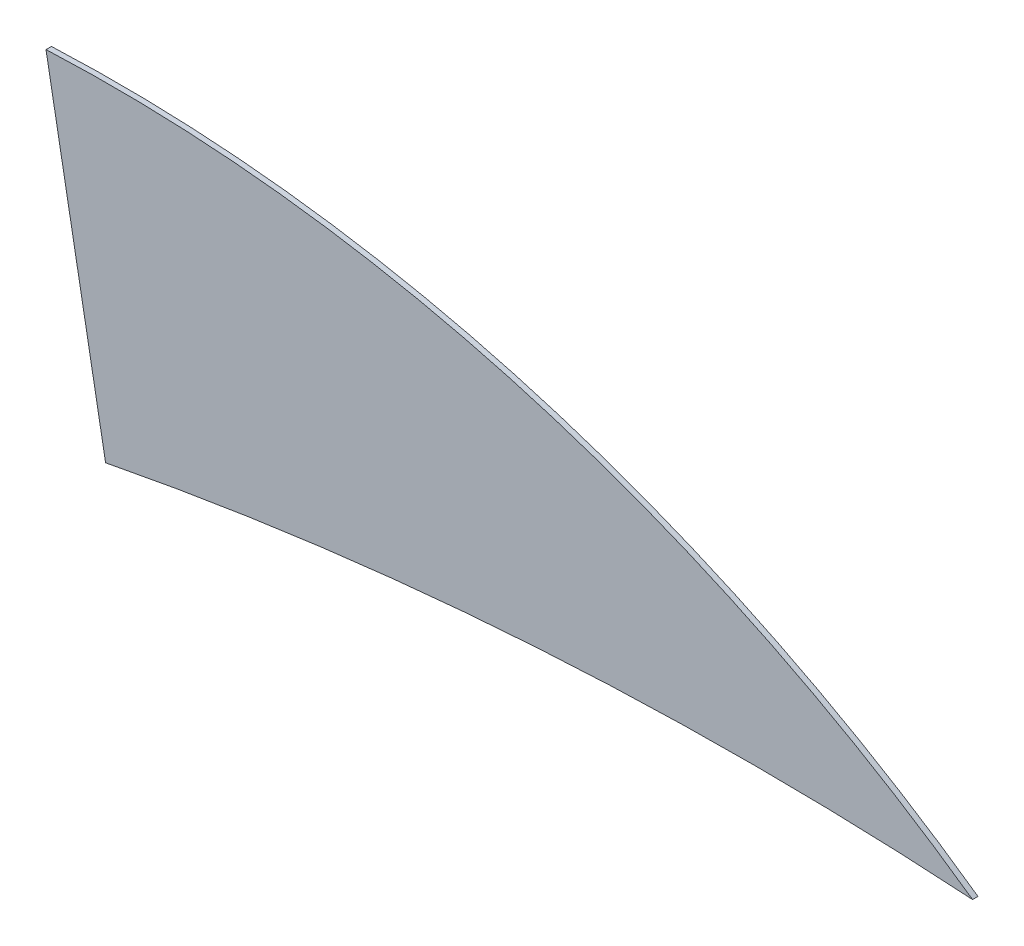
ISO-10303-21;
HEADER;
FILE_DESCRIPTION(('STEP AP214'),'2;1');
FILE_NAME('part.step','',(''),(''),'','','');
FILE_SCHEMA(('AUTOMOTIVE_DESIGN { 1 0 10303 214 1 1 1 1 }'));
ENDSEC;
DATA;
#1=APPLICATION_CONTEXT('core data for automotive mechanical design processes');
#2=APPLICATION_PROTOCOL_DEFINITION('international standard','automotive_design',2000,#1);
#3=PRODUCT_CONTEXT('',#1,'mechanical');
#4=PRODUCT('Part','Part','',(#3));
#5=PRODUCT_RELATED_PRODUCT_CATEGORY('part','',(#4));
#6=PRODUCT_DEFINITION_FORMATION('','',#4);
#7=PRODUCT_DEFINITION_CONTEXT('part definition',#1,'design');
#8=PRODUCT_DEFINITION('design','',#6,#7);
#9=PRODUCT_DEFINITION_SHAPE('','',#8);
#10=(LENGTH_UNIT() NAMED_UNIT(*) SI_UNIT(.MILLI.,.METRE.));
#11=(NAMED_UNIT(*) PLANE_ANGLE_UNIT() SI_UNIT($,.RADIAN.));
#12=(NAMED_UNIT(*) SI_UNIT($,.STERADIAN.) SOLID_ANGLE_UNIT());
#13=UNCERTAINTY_MEASURE_WITH_UNIT(LENGTH_MEASURE(1.E-05),#10,'distance_accuracy_value','');
#14=(GEOMETRIC_REPRESENTATION_CONTEXT(3) GLOBAL_UNCERTAINTY_ASSIGNED_CONTEXT((#13)) GLOBAL_UNIT_ASSIGNED_CONTEXT((#10,
#11,#12)) REPRESENTATION_CONTEXT('',''));
#15=CARTESIAN_POINT('',(0.,0.,0.));
#16=DIRECTION('',(0.,0.,1.));
#17=DIRECTION('',(1.,0.,0.));
#18=AXIS2_PLACEMENT_3D('',#15,#16,#17);
#19=CARTESIAN_POINT('',(33.3826103237859,-44.6625024563347,0.1));
#20=DIRECTION('',(0.,0.,-1.));
#21=DIRECTION('',(-1.,0.,0.));
#22=AXIS2_PLACEMENT_3D('',#19,#20,#21);
#23=CYLINDRICAL_SURFACE('',#22,62.3734768028814);
#24=CARTESIAN_POINT('',(33.3826103237859,-44.6625024563347,0.));
#25=DIRECTION('',(0.,0.,-1.));
#26=DIRECTION('',(1.,0.,0.));
#27=AXIS2_PLACEMENT_3D('',#24,#25,#26);
#28=CIRCLE('',#27,62.3734768028814);
#29=CARTESIAN_POINT('',(21.4501333277734,16.5589529430531,0.));
#30=VERTEX_POINT('',#29);
#31=CARTESIAN_POINT('',(37.4511852992327,17.5781378532633,0.));
#32=VERTEX_POINT('',#31);
#33=EDGE_CURVE('E80',#30,#32,#28,.T.);
#34=ORIENTED_EDGE('',*,*,#33,.T.);
#35=DIRECTION('',(0.,0.,-1.));
#36=VECTOR('',#35,1.);
#37=CARTESIAN_POINT('',(37.4511852992327,17.5781378532633,0.1));
#38=LINE('',#37,#36);
#39=CARTESIAN_POINT('',(37.4511852992327,17.5781378532633,0.1));
#40=VERTEX_POINT('',#39);
#41=EDGE_CURVE('E11',#40,#32,#38,.T.);
#42=ORIENTED_EDGE('',*,*,#41,.F.);
#43=CARTESIAN_POINT('',(33.3826103237859,-44.6625024563347,0.1));
#44=DIRECTION('',(0.,0.,-1.));
#45=DIRECTION('',(1.,0.,0.));
#46=AXIS2_PLACEMENT_3D('',#43,#44,#45);
#47=CIRCLE('',#46,62.3734768028814);
#48=CARTESIAN_POINT('',(21.4501333277734,16.5589529430531,0.1));
#49=VERTEX_POINT('',#48);
#50=EDGE_CURVE('E73',#49,#40,#47,.T.);
#51=ORIENTED_EDGE('',*,*,#50,.F.);
#52=DIRECTION('',(0.,0.,-1.));
#53=VECTOR('',#52,1.);
#54=CARTESIAN_POINT('',(21.4501333277734,16.5589529430531,0.1));
#55=LINE('',#54,#53);
#56=EDGE_CURVE('E81',#49,#30,#55,.T.);
#57=ORIENTED_EDGE('',*,*,#56,.T.);
#58=EDGE_LOOP('',(#34,#42,#51,#57));
#59=FACE_BOUND('',#58,.T.);
#60=ADVANCED_FACE('F33',(#59),#23,.F.);
#61=CARTESIAN_POINT('',(21.5745806738442,-4.78384400366581,0.1));
#62=DIRECTION('',(0.,0.,-1.));
#63=DIRECTION('',(-1.,0.,0.));
#64=AXIS2_PLACEMENT_3D('',#61,#62,#63);
#65=CYLINDRICAL_SURFACE('',#64,27.4248939287017);
#66=CARTESIAN_POINT('',(21.5745806738442,-4.78384400366581,0.));
#67=DIRECTION('',(0.,0.,1.));
#68=DIRECTION('',(1.,0.,0.));
#69=AXIS2_PLACEMENT_3D('',#66,#67,#68);
#70=CIRCLE('',#69,27.4248939287017);
#71=CARTESIAN_POINT('',(20.3503986351879,22.6137140140987,0.));
#72=VERTEX_POINT('',#71);
#73=EDGE_CURVE('E61',#32,#72,#70,.T.);
#74=ORIENTED_EDGE('',*,*,#73,.T.);
#75=DIRECTION('',(0.,0.,-1.));
#76=VECTOR('',#75,1.);
#77=CARTESIAN_POINT('',(20.3503986351879,22.6137140140987,0.1));
#78=LINE('',#77,#76);
#79=CARTESIAN_POINT('',(20.3503986351879,22.6137140140987,0.1));
#80=VERTEX_POINT('',#79);
#81=EDGE_CURVE('E41',#80,#72,#78,.T.);
#82=ORIENTED_EDGE('',*,*,#81,.F.);
#83=CARTESIAN_POINT('',(21.5745806738442,-4.78384400366581,0.1));
#84=DIRECTION('',(0.,0.,1.));
#85=DIRECTION('',(1.,0.,0.));
#86=AXIS2_PLACEMENT_3D('',#83,#84,#85);
#87=CIRCLE('',#86,27.4248939287017);
#88=EDGE_CURVE('E69',#40,#80,#87,.T.);
#89=ORIENTED_EDGE('',*,*,#88,.F.);
#90=ORIENTED_EDGE('',*,*,#41,.T.);
#91=EDGE_LOOP('',(#74,#82,#89,#90));
#92=FACE_BOUND('',#91,.T.);
#93=ADVANCED_FACE('F70',(#92),#65,.T.);
#94=CARTESIAN_POINT('',(21.4501333277734,16.5589529430531,0.1));
#95=DIRECTION('',(0.983902239494954,0.1787075351428,0.));
#96=DIRECTION('',(-0.1787075351428,0.983902239494954,0.));
#97=AXIS2_PLACEMENT_3D('',#94,#95,#96);
#98=PLANE('',#97);
#99=DIRECTION('',(0.1787075351428,-0.983902239494954,0.));
#100=VECTOR('',#99,1.);
#101=CARTESIAN_POINT('',(21.4501333277734,16.5589529430531,0.));
#102=LINE('',#101,#100);
#103=EDGE_CURVE('E66',#72,#30,#102,.T.);
#104=ORIENTED_EDGE('',*,*,#103,.T.);
#105=ORIENTED_EDGE('',*,*,#56,.F.);
#106=DIRECTION('',(0.1787075351428,-0.983902239494954,0.));
#107=VECTOR('',#106,1.);
#108=CARTESIAN_POINT('',(21.4501333277734,16.5589529430531,0.1));
#109=LINE('',#108,#107);
#110=EDGE_CURVE('E49',#80,#49,#109,.T.);
#111=ORIENTED_EDGE('',*,*,#110,.F.);
#112=ORIENTED_EDGE('',*,*,#81,.T.);
#113=EDGE_LOOP('',(#104,#105,#111,#112));
#114=FACE_BOUND('',#113,.T.);
#115=ADVANCED_FACE('F88',(#114),#98,.F.);
#116=CARTESIAN_POINT('',(33.3826103237859,-44.6625024563347,0.1));
#117=DIRECTION('',(0.,0.,1.));
#118=DIRECTION('',(1.,0.,0.));
#119=AXIS2_PLACEMENT_3D('',#116,#117,#118);
#120=PLANE('',#119);
#121=ORIENTED_EDGE('',*,*,#50,.T.);
#122=ORIENTED_EDGE('',*,*,#88,.T.);
#123=ORIENTED_EDGE('',*,*,#110,.T.);
#124=EDGE_LOOP('',(#121,#122,#123));
#125=FACE_BOUND('',#124,.T.);
#126=ADVANCED_FACE('F76',(#125),#120,.T.);
#127=CARTESIAN_POINT('',(33.3826103237859,-44.6625024563347,0.));
#128=DIRECTION('',(0.,0.,1.));
#129=DIRECTION('',(1.,0.,0.));
#130=AXIS2_PLACEMENT_3D('',#127,#128,#129);
#131=PLANE('',#130);
#132=ORIENTED_EDGE('',*,*,#33,.F.);
#133=ORIENTED_EDGE('',*,*,#103,.F.);
#134=ORIENTED_EDGE('',*,*,#73,.F.);
#135=EDGE_LOOP('',(#132,#133,#134));
#136=FACE_BOUND('',#135,.T.);
#137=ADVANCED_FACE('F89',(#136),#131,.F.);
#138=CLOSED_SHELL('',(#60,#93,#115,#126,#137));
#139=MANIFOLD_SOLID_BREP('B2',#138);
#140=ADVANCED_BREP_SHAPE_REPRESENTATION('',(#18,#139),#14);
#141=SHAPE_DEFINITION_REPRESENTATION(#9,#140);
ENDSEC;
END-ISO-10303-21;
